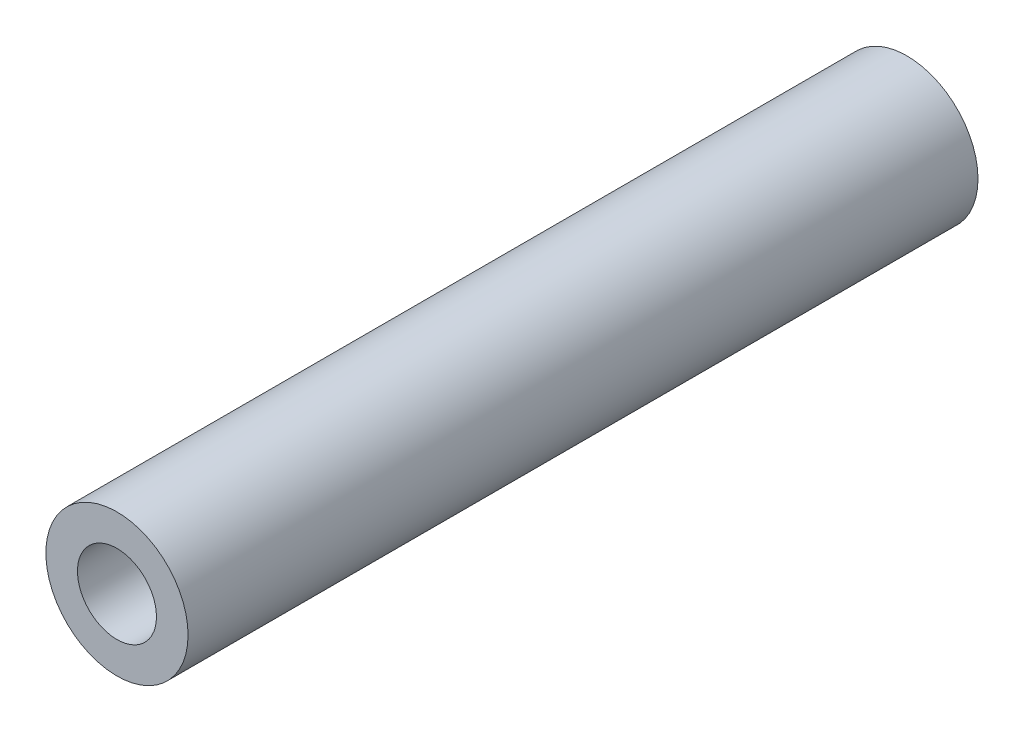
ISO-10303-21;
HEADER;
FILE_DESCRIPTION(('STEP AP214'),'2;1');
FILE_NAME('part.step','',(''),(''),'','','');
FILE_SCHEMA(('AUTOMOTIVE_DESIGN { 1 0 10303 214 1 1 1 1 }'));
ENDSEC;
DATA;
#1=APPLICATION_CONTEXT('core data for automotive mechanical design processes');
#2=APPLICATION_PROTOCOL_DEFINITION('international standard','automotive_design',2000,#1);
#3=PRODUCT_CONTEXT('',#1,'mechanical');
#4=PRODUCT('Part','Part','',(#3));
#5=PRODUCT_RELATED_PRODUCT_CATEGORY('part','',(#4));
#6=PRODUCT_DEFINITION_FORMATION('','',#4);
#7=PRODUCT_DEFINITION_CONTEXT('part definition',#1,'design');
#8=PRODUCT_DEFINITION('design','',#6,#7);
#9=PRODUCT_DEFINITION_SHAPE('','',#8);
#10=(LENGTH_UNIT() NAMED_UNIT(*) SI_UNIT(.MILLI.,.METRE.));
#11=(NAMED_UNIT(*) PLANE_ANGLE_UNIT() SI_UNIT($,.RADIAN.));
#12=(NAMED_UNIT(*) SI_UNIT($,.STERADIAN.) SOLID_ANGLE_UNIT());
#13=UNCERTAINTY_MEASURE_WITH_UNIT(LENGTH_MEASURE(1.E-05),#10,'distance_accuracy_value','');
#14=(GEOMETRIC_REPRESENTATION_CONTEXT(3) GLOBAL_UNCERTAINTY_ASSIGNED_CONTEXT((#13)) GLOBAL_UNIT_ASSIGNED_CONTEXT((#10,
#11,#12)) REPRESENTATION_CONTEXT('',''));
#15=CARTESIAN_POINT('',(0.,0.,0.));
#16=DIRECTION('',(0.,0.,1.));
#17=DIRECTION('',(1.,0.,0.));
#18=AXIS2_PLACEMENT_3D('',#15,#16,#17);
#19=CARTESIAN_POINT('',(0.,0.,31.75));
#20=DIRECTION('',(0.,0.,1.));
#21=DIRECTION('',(1.,0.,0.));
#22=AXIS2_PLACEMENT_3D('',#19,#20,#21);
#23=PLANE('',#22);
#24=CARTESIAN_POINT('',(0.,0.,31.75));
#25=DIRECTION('',(0.,0.,1.));
#26=DIRECTION('',(1.,0.,0.));
#27=AXIS2_PLACEMENT_3D('',#24,#25,#26);
#28=CIRCLE('',#27,2.8575);
#29=CARTESIAN_POINT('',(2.8575,0.,31.75));
#30=VERTEX_POINT('',#29);
#31=EDGE_CURVE('E10',#30,#30,#28,.T.);
#32=ORIENTED_EDGE('',*,*,#31,.T.);
#33=EDGE_LOOP('',(#32));
#34=FACE_BOUND('',#33,.T.);
#35=CARTESIAN_POINT('',(0.,0.,31.75));
#36=DIRECTION('',(0.,0.,1.));
#37=DIRECTION('',(1.,0.,0.));
#38=AXIS2_PLACEMENT_3D('',#35,#36,#37);
#39=CIRCLE('',#38,1.5875);
#40=CARTESIAN_POINT('',(1.5875,0.,31.75));
#41=VERTEX_POINT('',#40);
#42=EDGE_CURVE('E42',#41,#41,#39,.T.);
#43=ORIENTED_EDGE('',*,*,#42,.F.);
#44=EDGE_LOOP('',(#43));
#45=FACE_BOUND('',#44,.T.);
#46=ADVANCED_FACE('F31',(#34,#45),#23,.T.);
#47=CARTESIAN_POINT('',(0.,0.,0.));
#48=DIRECTION('',(0.,0.,1.));
#49=DIRECTION('',(1.,0.,0.));
#50=AXIS2_PLACEMENT_3D('',#47,#48,#49);
#51=PLANE('',#50);
#52=CARTESIAN_POINT('',(0.,0.,0.));
#53=DIRECTION('',(0.,0.,1.));
#54=DIRECTION('',(1.,0.,0.));
#55=AXIS2_PLACEMENT_3D('',#52,#53,#54);
#56=CIRCLE('',#55,2.8575);
#57=CARTESIAN_POINT('',(2.8575,0.,0.));
#58=VERTEX_POINT('',#57);
#59=EDGE_CURVE('E35',#58,#58,#56,.T.);
#60=ORIENTED_EDGE('',*,*,#59,.F.);
#61=EDGE_LOOP('',(#60));
#62=FACE_BOUND('',#61,.T.);
#63=CARTESIAN_POINT('',(0.,0.,0.));
#64=DIRECTION('',(0.,0.,1.));
#65=DIRECTION('',(1.,0.,0.));
#66=AXIS2_PLACEMENT_3D('',#63,#64,#65);
#67=CIRCLE('',#66,1.5875);
#68=CARTESIAN_POINT('',(1.5875,0.,0.));
#69=VERTEX_POINT('',#68);
#70=EDGE_CURVE('E44',#69,#69,#67,.T.);
#71=ORIENTED_EDGE('',*,*,#70,.T.);
#72=EDGE_LOOP('',(#71));
#73=FACE_BOUND('',#72,.T.);
#74=ADVANCED_FACE('F54',(#62,#73),#51,.F.);
#75=CARTESIAN_POINT('',(0.,0.,31.75));
#76=DIRECTION('',(0.,0.,-1.));
#77=DIRECTION('',(-1.,0.,0.));
#78=AXIS2_PLACEMENT_3D('',#75,#76,#77);
#79=CYLINDRICAL_SURFACE('',#78,2.8575);
#80=ORIENTED_EDGE('',*,*,#31,.F.);
#81=EDGE_LOOP('',(#80));
#82=FACE_BOUND('',#81,.T.);
#83=ORIENTED_EDGE('',*,*,#59,.T.);
#84=EDGE_LOOP('',(#83));
#85=FACE_BOUND('',#84,.T.);
#86=ADVANCED_FACE('F33',(#82,#85),#79,.T.);
#87=CARTESIAN_POINT('',(0.,0.,31.75));
#88=DIRECTION('',(0.,0.,-1.));
#89=DIRECTION('',(-1.,0.,0.));
#90=AXIS2_PLACEMENT_3D('',#87,#88,#89);
#91=CYLINDRICAL_SURFACE('',#90,1.5875);
#92=ORIENTED_EDGE('',*,*,#42,.T.);
#93=EDGE_LOOP('',(#92));
#94=FACE_BOUND('',#93,.T.);
#95=ORIENTED_EDGE('',*,*,#70,.F.);
#96=EDGE_LOOP('',(#95));
#97=FACE_BOUND('',#96,.T.);
#98=ADVANCED_FACE('F50',(#94,#97),#91,.F.);
#99=CLOSED_SHELL('',(#46,#74,#86,#98));
#100=MANIFOLD_SOLID_BREP('B2',#99);
#101=ADVANCED_BREP_SHAPE_REPRESENTATION('',(#18,#100),#14);
#102=SHAPE_DEFINITION_REPRESENTATION(#9,#101);
ENDSEC;
END-ISO-10303-21;
